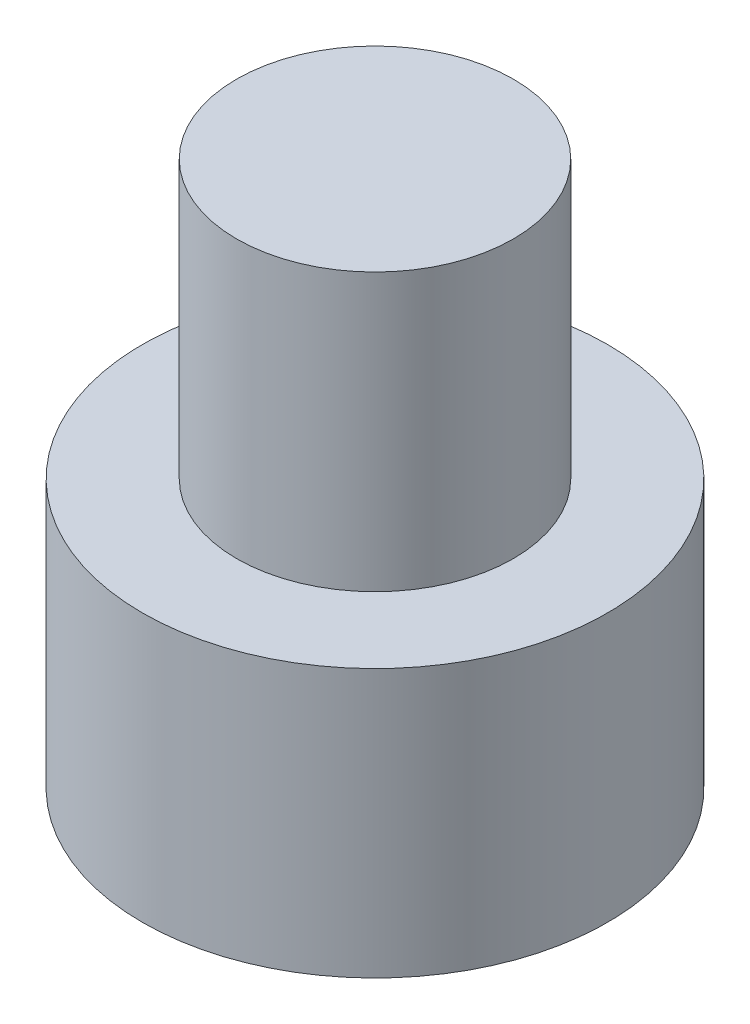
ISO-10303-21;
HEADER;
FILE_DESCRIPTION(('STEP AP214'),'2;1');
FILE_NAME('part.step','',(''),(''),'','','');
FILE_SCHEMA(('AUTOMOTIVE_DESIGN { 1 0 10303 214 1 1 1 1 }'));
ENDSEC;
DATA;
#1=APPLICATION_CONTEXT('core data for automotive mechanical design processes');
#2=APPLICATION_PROTOCOL_DEFINITION('international standard','automotive_design',2000,#1);
#3=PRODUCT_CONTEXT('',#1,'mechanical');
#4=PRODUCT('Part','Part','',(#3));
#5=PRODUCT_RELATED_PRODUCT_CATEGORY('part','',(#4));
#6=PRODUCT_DEFINITION_FORMATION('','',#4);
#7=PRODUCT_DEFINITION_CONTEXT('part definition',#1,'design');
#8=PRODUCT_DEFINITION('design','',#6,#7);
#9=PRODUCT_DEFINITION_SHAPE('','',#8);
#10=(LENGTH_UNIT() NAMED_UNIT(*) SI_UNIT(.MILLI.,.METRE.));
#11=(NAMED_UNIT(*) PLANE_ANGLE_UNIT() SI_UNIT($,.RADIAN.));
#12=(NAMED_UNIT(*) SI_UNIT($,.STERADIAN.) SOLID_ANGLE_UNIT());
#13=UNCERTAINTY_MEASURE_WITH_UNIT(LENGTH_MEASURE(1.E-05),#10,'distance_accuracy_value','');
#14=(GEOMETRIC_REPRESENTATION_CONTEXT(3) GLOBAL_UNCERTAINTY_ASSIGNED_CONTEXT((#13)) GLOBAL_UNIT_ASSIGNED_CONTEXT((#10,
#11,#12)) REPRESENTATION_CONTEXT('',''));
#15=CARTESIAN_POINT('',(0.,0.,0.));
#16=DIRECTION('',(0.,0.,1.));
#17=DIRECTION('',(1.,0.,0.));
#18=AXIS2_PLACEMENT_3D('',#15,#16,#17);
#19=CARTESIAN_POINT('',(0.,4.84,0.));
#20=DIRECTION('',(0.,-1.,0.));
#21=DIRECTION('',(0.,0.,-1.));
#22=AXIS2_PLACEMENT_3D('',#19,#20,#21);
#23=CYLINDRICAL_SURFACE('',#22,4.2);
#24=CARTESIAN_POINT('',(0.,4.84,0.));
#25=DIRECTION('',(0.,1.,0.));
#26=DIRECTION('',(0.,0.,1.));
#27=AXIS2_PLACEMENT_3D('',#24,#25,#26);
#28=CIRCLE('',#27,4.2);
#29=CARTESIAN_POINT('',(0.,4.84,4.2));
#30=VERTEX_POINT('',#29);
#31=EDGE_CURVE('E43',#30,#30,#28,.T.);
#32=ORIENTED_EDGE('',*,*,#31,.F.);
#33=EDGE_LOOP('',(#32));
#34=FACE_BOUND('',#33,.T.);
#35=CARTESIAN_POINT('',(0.,0.,0.));
#36=DIRECTION('',(0.,1.,0.));
#37=DIRECTION('',(0.,0.,1.));
#38=AXIS2_PLACEMENT_3D('',#35,#36,#37);
#39=CIRCLE('',#38,4.2);
#40=CARTESIAN_POINT('',(0.,0.,4.2));
#41=VERTEX_POINT('',#40);
#42=EDGE_CURVE('E38',#41,#41,#39,.T.);
#43=ORIENTED_EDGE('',*,*,#42,.T.);
#44=EDGE_LOOP('',(#43));
#45=FACE_BOUND('',#44,.T.);
#46=ADVANCED_FACE('F35',(#34,#45),#23,.T.);
#47=CARTESIAN_POINT('',(0.,4.84,0.));
#48=DIRECTION('',(0.,1.,0.));
#49=DIRECTION('',(0.,0.,1.));
#50=AXIS2_PLACEMENT_3D('',#47,#48,#49);
#51=PLANE('',#50);
#52=CARTESIAN_POINT('',(0.,4.84,0.));
#53=DIRECTION('',(0.,1.,0.));
#54=DIRECTION('',(0.,0.,1.));
#55=AXIS2_PLACEMENT_3D('',#52,#53,#54);
#56=CIRCLE('',#55,2.5);
#57=CARTESIAN_POINT('',(0.,4.84,2.5));
#58=VERTEX_POINT('',#57);
#59=EDGE_CURVE('E11',#58,#58,#56,.T.);
#60=ORIENTED_EDGE('',*,*,#59,.F.);
#61=EDGE_LOOP('',(#60));
#62=FACE_BOUND('',#61,.T.);
#63=ORIENTED_EDGE('',*,*,#31,.T.);
#64=EDGE_LOOP('',(#63));
#65=FACE_BOUND('',#64,.T.);
#66=ADVANCED_FACE('F155',(#62,#65),#51,.T.);
#67=CARTESIAN_POINT('',(0.,0.,0.));
#68=DIRECTION('',(0.,1.,0.));
#69=DIRECTION('',(0.,0.,1.));
#70=AXIS2_PLACEMENT_3D('',#67,#68,#69);
#71=PLANE('',#70);
#72=DIRECTION('',(-0.5,0.,0.866025403784439));
#73=VECTOR('',#72,1.);
#74=CARTESIAN_POINT('',(2.3,0.,0.));
#75=LINE('',#74,#73);
#76=CARTESIAN_POINT('',(2.3,0.,0.));
#77=VERTEX_POINT('',#76);
#78=CARTESIAN_POINT('',(1.15,0.,1.99185842870421));
#79=VERTEX_POINT('',#78);
#80=EDGE_CURVE('E125',#77,#79,#75,.T.);
#81=ORIENTED_EDGE('',*,*,#80,.F.);
#82=DIRECTION('',(0.5,0.,0.866025403784439));
#83=VECTOR('',#82,1.);
#84=CARTESIAN_POINT('',(1.15,0.,-1.99185842870421));
#85=LINE('',#84,#83);
#86=CARTESIAN_POINT('',(1.15,0.,-1.99185842870421));
#87=VERTEX_POINT('',#86);
#88=EDGE_CURVE('E51',#87,#77,#85,.T.);
#89=ORIENTED_EDGE('',*,*,#88,.F.);
#90=DIRECTION('',(1.,0.,0.));
#91=VECTOR('',#90,1.);
#92=CARTESIAN_POINT('',(-1.15,0.,-1.99185842870421));
#93=LINE('',#92,#91);
#94=CARTESIAN_POINT('',(-1.15,0.,-1.99185842870421));
#95=VERTEX_POINT('',#94);
#96=EDGE_CURVE('E134',#95,#87,#93,.T.);
#97=ORIENTED_EDGE('',*,*,#96,.F.);
#98=DIRECTION('',(0.5,0.,-0.866025403784439));
#99=VECTOR('',#98,1.);
#100=CARTESIAN_POINT('',(-2.3,0.,0.));
#101=LINE('',#100,#99);
#102=CARTESIAN_POINT('',(-2.3,0.,0.));
#103=VERTEX_POINT('',#102);
#104=EDGE_CURVE('E132',#103,#95,#101,.T.);
#105=ORIENTED_EDGE('',*,*,#104,.F.);
#106=DIRECTION('',(-0.5,0.,-0.866025403784439));
#107=VECTOR('',#106,1.);
#108=CARTESIAN_POINT('',(-1.15,0.,1.99185842870421));
#109=LINE('',#108,#107);
#110=CARTESIAN_POINT('',(-1.15,0.,1.99185842870421));
#111=VERTEX_POINT('',#110);
#112=EDGE_CURVE('E99',#111,#103,#109,.T.);
#113=ORIENTED_EDGE('',*,*,#112,.F.);
#114=DIRECTION('',(-1.,0.,0.));
#115=VECTOR('',#114,1.);
#116=CARTESIAN_POINT('',(1.15,0.,1.99185842870421));
#117=LINE('',#116,#115);
#118=EDGE_CURVE('E128',#79,#111,#117,.T.);
#119=ORIENTED_EDGE('',*,*,#118,.F.);
#120=EDGE_LOOP('',(#81,#89,#97,#105,#113,#119));
#121=FACE_BOUND('',#120,.T.);
#122=ORIENTED_EDGE('',*,*,#42,.F.);
#123=EDGE_LOOP('',(#122));
#124=FACE_BOUND('',#123,.T.);
#125=ADVANCED_FACE('F152',(#121,#124),#71,.F.);
#126=CARTESIAN_POINT('',(0.,9.84,0.));
#127=DIRECTION('',(0.,-1.,0.));
#128=DIRECTION('',(0.,0.,-1.));
#129=AXIS2_PLACEMENT_3D('',#126,#127,#128);
#130=CYLINDRICAL_SURFACE('',#129,2.5);
#131=CARTESIAN_POINT('',(0.,9.84,0.));
#132=DIRECTION('',(0.,1.,0.));
#133=DIRECTION('',(0.,0.,1.));
#134=AXIS2_PLACEMENT_3D('',#131,#132,#133);
#135=CIRCLE('',#134,2.5);
#136=CARTESIAN_POINT('',(0.,9.84,2.5));
#137=VERTEX_POINT('',#136);
#138=EDGE_CURVE('E138',#137,#137,#135,.T.);
#139=ORIENTED_EDGE('',*,*,#138,.F.);
#140=EDGE_LOOP('',(#139));
#141=FACE_BOUND('',#140,.T.);
#142=ORIENTED_EDGE('',*,*,#59,.T.);
#143=EDGE_LOOP('',(#142));
#144=FACE_BOUND('',#143,.T.);
#145=ADVANCED_FACE('F154',(#141,#144),#130,.T.);
#146=CARTESIAN_POINT('',(0.,9.84,0.));
#147=DIRECTION('',(0.,1.,0.));
#148=DIRECTION('',(0.,0.,1.));
#149=AXIS2_PLACEMENT_3D('',#146,#147,#148);
#150=PLANE('',#149);
#151=ORIENTED_EDGE('',*,*,#138,.T.);
#152=EDGE_LOOP('',(#151));
#153=FACE_BOUND('',#152,.T.);
#154=ADVANCED_FACE('F161',(#153),#150,.T.);
#155=CARTESIAN_POINT('',(1.15,3.4,-1.99185842870421));
#156=DIRECTION('',(0.866025403784439,0.,-0.5));
#157=DIRECTION('',(-0.5,0.,-0.866025403784439));
#158=AXIS2_PLACEMENT_3D('',#155,#156,#157);
#159=PLANE('',#158);
#160=ORIENTED_EDGE('',*,*,#88,.T.);
#161=DIRECTION('',(0.,-1.,0.));
#162=VECTOR('',#161,1.);
#163=CARTESIAN_POINT('',(2.3,3.4,0.));
#164=LINE('',#163,#162);
#165=CARTESIAN_POINT('',(2.3,3.4,0.));
#166=VERTEX_POINT('',#165);
#167=EDGE_CURVE('E81',#166,#77,#164,.T.);
#168=ORIENTED_EDGE('',*,*,#167,.F.);
#169=DIRECTION('',(0.5,0.,0.866025403784439));
#170=VECTOR('',#169,1.);
#171=CARTESIAN_POINT('',(1.15,3.4,-1.99185842870421));
#172=LINE('',#171,#170);
#173=CARTESIAN_POINT('',(1.15,3.4,-1.99185842870421));
#174=VERTEX_POINT('',#173);
#175=EDGE_CURVE('E136',#174,#166,#172,.T.);
#176=ORIENTED_EDGE('',*,*,#175,.F.);
#177=DIRECTION('',(0.,-1.,0.));
#178=VECTOR('',#177,1.);
#179=CARTESIAN_POINT('',(1.15,3.4,-1.99185842870421));
#180=LINE('',#179,#178);
#181=EDGE_CURVE('E59',#174,#87,#180,.T.);
#182=ORIENTED_EDGE('',*,*,#181,.T.);
#183=EDGE_LOOP('',(#160,#168,#176,#182));
#184=FACE_BOUND('',#183,.T.);
#185=ADVANCED_FACE('F190',(#184),#159,.F.);
#186=CARTESIAN_POINT('',(-1.15,3.4,-1.99185842870421));
#187=DIRECTION('',(0.,0.,-1.));
#188=DIRECTION('',(-1.,0.,0.));
#189=AXIS2_PLACEMENT_3D('',#186,#187,#188);
#190=PLANE('',#189);
#191=ORIENTED_EDGE('',*,*,#96,.T.);
#192=ORIENTED_EDGE('',*,*,#181,.F.);
#193=DIRECTION('',(1.,0.,0.));
#194=VECTOR('',#193,1.);
#195=CARTESIAN_POINT('',(-1.15,3.4,-1.99185842870421));
#196=LINE('',#195,#194);
#197=CARTESIAN_POINT('',(-1.15,3.4,-1.99185842870421));
#198=VERTEX_POINT('',#197);
#199=EDGE_CURVE('E111',#198,#174,#196,.T.);
#200=ORIENTED_EDGE('',*,*,#199,.F.);
#201=DIRECTION('',(0.,-1.,0.));
#202=VECTOR('',#201,1.);
#203=CARTESIAN_POINT('',(-1.15,3.4,-1.99185842870421));
#204=LINE('',#203,#202);
#205=EDGE_CURVE('E103',#198,#95,#204,.T.);
#206=ORIENTED_EDGE('',*,*,#205,.T.);
#207=EDGE_LOOP('',(#191,#192,#200,#206));
#208=FACE_BOUND('',#207,.T.);
#209=ADVANCED_FACE('F204',(#208),#190,.F.);
#210=CARTESIAN_POINT('',(-2.3,3.4,0.));
#211=DIRECTION('',(-0.866025403784439,0.,-0.5));
#212=DIRECTION('',(-0.5,0.,0.866025403784439));
#213=AXIS2_PLACEMENT_3D('',#210,#211,#212);
#214=PLANE('',#213);
#215=ORIENTED_EDGE('',*,*,#104,.T.);
#216=ORIENTED_EDGE('',*,*,#205,.F.);
#217=DIRECTION('',(0.5,0.,-0.866025403784439));
#218=VECTOR('',#217,1.);
#219=CARTESIAN_POINT('',(-2.3,3.4,0.));
#220=LINE('',#219,#218);
#221=CARTESIAN_POINT('',(-2.3,3.4,0.));
#222=VERTEX_POINT('',#221);
#223=EDGE_CURVE('E107',#222,#198,#220,.T.);
#224=ORIENTED_EDGE('',*,*,#223,.F.);
#225=DIRECTION('',(0.,-1.,0.));
#226=VECTOR('',#225,1.);
#227=CARTESIAN_POINT('',(-2.3,3.4,0.));
#228=LINE('',#227,#226);
#229=EDGE_CURVE('E92',#222,#103,#228,.T.);
#230=ORIENTED_EDGE('',*,*,#229,.T.);
#231=EDGE_LOOP('',(#215,#216,#224,#230));
#232=FACE_BOUND('',#231,.T.);
#233=ADVANCED_FACE('F108',(#232),#214,.F.);
#234=CARTESIAN_POINT('',(-1.15,3.4,1.99185842870421));
#235=DIRECTION('',(-0.866025403784439,0.,0.5));
#236=DIRECTION('',(0.5,0.,0.866025403784439));
#237=AXIS2_PLACEMENT_3D('',#234,#235,#236);
#238=PLANE('',#237);
#239=ORIENTED_EDGE('',*,*,#112,.T.);
#240=ORIENTED_EDGE('',*,*,#229,.F.);
#241=DIRECTION('',(-0.5,0.,-0.866025403784439));
#242=VECTOR('',#241,1.);
#243=CARTESIAN_POINT('',(-1.15,3.4,1.99185842870421));
#244=LINE('',#243,#242);
#245=CARTESIAN_POINT('',(-1.15,3.4,1.99185842870421));
#246=VERTEX_POINT('',#245);
#247=EDGE_CURVE('E96',#246,#222,#244,.T.);
#248=ORIENTED_EDGE('',*,*,#247,.F.);
#249=DIRECTION('',(0.,-1.,0.));
#250=VECTOR('',#249,1.);
#251=CARTESIAN_POINT('',(-1.15,3.4,1.99185842870421));
#252=LINE('',#251,#250);
#253=EDGE_CURVE('E104',#246,#111,#252,.T.);
#254=ORIENTED_EDGE('',*,*,#253,.T.);
#255=EDGE_LOOP('',(#239,#240,#248,#254));
#256=FACE_BOUND('',#255,.T.);
#257=ADVANCED_FACE('F94',(#256),#238,.F.);
#258=CARTESIAN_POINT('',(1.15,3.4,1.99185842870421));
#259=DIRECTION('',(0.,0.,1.));
#260=DIRECTION('',(1.,0.,0.));
#261=AXIS2_PLACEMENT_3D('',#258,#259,#260);
#262=PLANE('',#261);
#263=ORIENTED_EDGE('',*,*,#118,.T.);
#264=ORIENTED_EDGE('',*,*,#253,.F.);
#265=DIRECTION('',(-1.,0.,0.));
#266=VECTOR('',#265,1.);
#267=CARTESIAN_POINT('',(1.15,3.4,1.99185842870421));
#268=LINE('',#267,#266);
#269=CARTESIAN_POINT('',(1.15,3.4,1.99185842870421));
#270=VERTEX_POINT('',#269);
#271=EDGE_CURVE('E117',#270,#246,#268,.T.);
#272=ORIENTED_EDGE('',*,*,#271,.F.);
#273=DIRECTION('',(0.,-1.,0.));
#274=VECTOR('',#273,1.);
#275=CARTESIAN_POINT('',(1.15,3.4,1.99185842870421));
#276=LINE('',#275,#274);
#277=EDGE_CURVE('E141',#270,#79,#276,.T.);
#278=ORIENTED_EDGE('',*,*,#277,.T.);
#279=EDGE_LOOP('',(#263,#264,#272,#278));
#280=FACE_BOUND('',#279,.T.);
#281=ADVANCED_FACE('F229',(#280),#262,.F.);
#282=CARTESIAN_POINT('',(2.3,3.4,0.));
#283=DIRECTION('',(0.866025403784439,0.,0.5));
#284=DIRECTION('',(0.5,0.,-0.866025403784439));
#285=AXIS2_PLACEMENT_3D('',#282,#283,#284);
#286=PLANE('',#285);
#287=ORIENTED_EDGE('',*,*,#80,.T.);
#288=ORIENTED_EDGE('',*,*,#277,.F.);
#289=DIRECTION('',(-0.5,0.,0.866025403784439));
#290=VECTOR('',#289,1.);
#291=CARTESIAN_POINT('',(2.3,3.4,0.));
#292=LINE('',#291,#290);
#293=EDGE_CURVE('E119',#166,#270,#292,.T.);
#294=ORIENTED_EDGE('',*,*,#293,.F.);
#295=ORIENTED_EDGE('',*,*,#167,.T.);
#296=EDGE_LOOP('',(#287,#288,#294,#295));
#297=FACE_BOUND('',#296,.T.);
#298=ADVANCED_FACE('F238',(#297),#286,.F.);
#299=CARTESIAN_POINT('',(0.,3.4,0.));
#300=DIRECTION('',(0.,-1.,0.));
#301=DIRECTION('',(0.,0.,-1.));
#302=AXIS2_PLACEMENT_3D('',#299,#300,#301);
#303=PLANE('',#302);
#304=ORIENTED_EDGE('',*,*,#175,.T.);
#305=ORIENTED_EDGE('',*,*,#293,.T.);
#306=ORIENTED_EDGE('',*,*,#271,.T.);
#307=ORIENTED_EDGE('',*,*,#247,.T.);
#308=ORIENTED_EDGE('',*,*,#223,.T.);
#309=ORIENTED_EDGE('',*,*,#199,.T.);
#310=EDGE_LOOP('',(#304,#305,#306,#307,#308,#309));
#311=FACE_BOUND('',#310,.T.);
#312=ADVANCED_FACE('F114',(#311),#303,.T.);
#313=CLOSED_SHELL('',(#46,#66,#125,#145,#154,#185,#209,#233,#257,#281,#298,#312));
#314=MANIFOLD_SOLID_BREP('B2',#313);
#315=ADVANCED_BREP_SHAPE_REPRESENTATION('',(#18,#314),#14);
#316=SHAPE_DEFINITION_REPRESENTATION(#9,#315);
ENDSEC;
END-ISO-10303-21;
